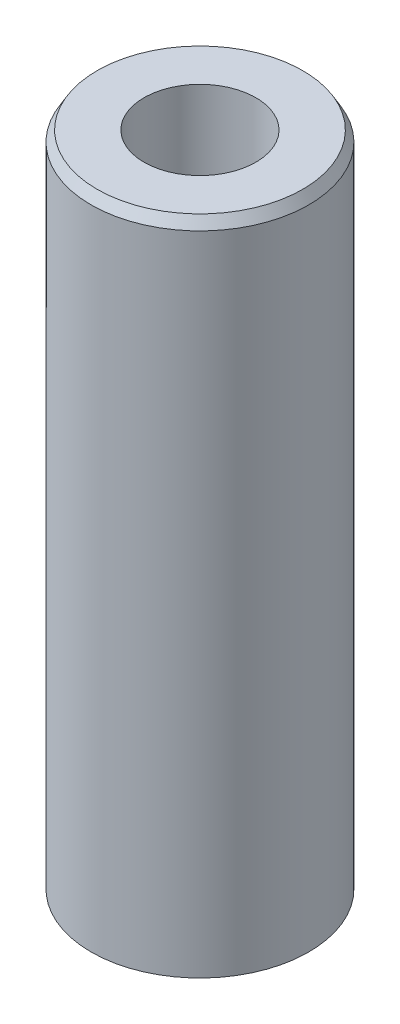
ISO-10303-21;
HEADER;
FILE_DESCRIPTION(('STEP AP214'),'2;1');
FILE_NAME('part.step','',(''),(''),'','','');
FILE_SCHEMA(('AUTOMOTIVE_DESIGN { 1 0 10303 214 1 1 1 1 }'));
ENDSEC;
DATA;
#1=APPLICATION_CONTEXT('core data for automotive mechanical design processes');
#2=APPLICATION_PROTOCOL_DEFINITION('international standard','automotive_design',2000,#1);
#3=PRODUCT_CONTEXT('',#1,'mechanical');
#4=PRODUCT('Part','Part','',(#3));
#5=PRODUCT_RELATED_PRODUCT_CATEGORY('part','',(#4));
#6=PRODUCT_DEFINITION_FORMATION('','',#4);
#7=PRODUCT_DEFINITION_CONTEXT('part definition',#1,'design');
#8=PRODUCT_DEFINITION('design','',#6,#7);
#9=PRODUCT_DEFINITION_SHAPE('','',#8);
#10=(LENGTH_UNIT() NAMED_UNIT(*) SI_UNIT(.MILLI.,.METRE.));
#11=(NAMED_UNIT(*) PLANE_ANGLE_UNIT() SI_UNIT($,.RADIAN.));
#12=(NAMED_UNIT(*) SI_UNIT($,.STERADIAN.) SOLID_ANGLE_UNIT());
#13=UNCERTAINTY_MEASURE_WITH_UNIT(LENGTH_MEASURE(1.E-05),#10,'distance_accuracy_value','');
#14=(GEOMETRIC_REPRESENTATION_CONTEXT(3) GLOBAL_UNCERTAINTY_ASSIGNED_CONTEXT((#13)) GLOBAL_UNIT_ASSIGNED_CONTEXT((#10,
#11,#12)) REPRESENTATION_CONTEXT('',''));
#15=CARTESIAN_POINT('',(0.,0.,0.));
#16=DIRECTION('',(0.,0.,1.));
#17=DIRECTION('',(1.,0.,0.));
#18=AXIS2_PLACEMENT_3D('',#15,#16,#17);
#19=CARTESIAN_POINT('',(0.,289.484519405649,0.));
#20=DIRECTION('',(0.,-1.,0.));
#21=DIRECTION('',(0.,0.,-1.));
#22=AXIS2_PLACEMENT_3D('',#19,#20,#21);
#23=CYLINDRICAL_SURFACE('',#22,47.5);
#24=CARTESIAN_POINT('',(0.,284.92137382186,0.));
#25=DIRECTION('',(0.,1.,0.));
#26=DIRECTION('',(0.,0.,1.));
#27=AXIS2_PLACEMENT_3D('',#24,#25,#26);
#28=CIRCLE('',#27,47.5);
#29=CARTESIAN_POINT('',(0.,284.92137382186,47.5));
#30=VERTEX_POINT('',#29);
#31=EDGE_CURVE('E50',#30,#30,#28,.F.);
#32=ORIENTED_EDGE('',*,*,#31,.T.);
#33=EDGE_LOOP('',(#32));
#34=FACE_BOUND('',#33,.T.);
#35=CARTESIAN_POINT('',(0.,2.6345333311521,0.));
#36=DIRECTION('',(0.,1.,0.));
#37=DIRECTION('',(0.,0.,1.));
#38=AXIS2_PLACEMENT_3D('',#35,#36,#37);
#39=CIRCLE('',#38,47.5);
#40=CARTESIAN_POINT('',(0.,2.6345333311521,47.5));
#41=VERTEX_POINT('',#40);
#42=EDGE_CURVE('E51',#41,#41,#39,.T.);
#43=ORIENTED_EDGE('',*,*,#42,.T.);
#44=EDGE_LOOP('',(#43));
#45=FACE_BOUND('',#44,.T.);
#46=ADVANCED_FACE('F39',(#34,#45),#23,.T.);
#47=CARTESIAN_POINT('',(0.,289.484519405649,0.));
#48=DIRECTION('',(0.,1.,0.));
#49=DIRECTION('',(0.,0.,1.));
#50=AXIS2_PLACEMENT_3D('',#47,#48,#49);
#51=PLANE('',#50);
#52=CARTESIAN_POINT('',(0.,289.484519405649,0.));
#53=DIRECTION('',(0.,1.,0.));
#54=DIRECTION('',(0.,0.,1.));
#55=AXIS2_PLACEMENT_3D('',#52,#53,#54);
#56=CIRCLE('',#55,44.8654666688479);
#57=CARTESIAN_POINT('',(0.,289.484519405649,44.8654666688479));
#58=VERTEX_POINT('',#57);
#59=EDGE_CURVE('E54',#58,#58,#56,.T.);
#60=ORIENTED_EDGE('',*,*,#59,.T.);
#61=EDGE_LOOP('',(#60));
#62=FACE_BOUND('',#61,.T.);
#63=CARTESIAN_POINT('',(0.,289.484519405649,0.));
#64=DIRECTION('',(0.,1.,0.));
#65=DIRECTION('',(0.,0.,1.));
#66=AXIS2_PLACEMENT_3D('',#63,#64,#65);
#67=CIRCLE('',#66,24.3999879885973);
#68=CARTESIAN_POINT('',(0.,289.484519405649,24.3999879885973));
#69=VERTEX_POINT('',#68);
#70=EDGE_CURVE('E58',#69,#69,#67,.T.);
#71=ORIENTED_EDGE('',*,*,#70,.F.);
#72=EDGE_LOOP('',(#71));
#73=FACE_BOUND('',#72,.T.);
#74=ADVANCED_FACE('F69',(#62,#73),#51,.T.);
#75=CARTESIAN_POINT('',(0.,0.,0.));
#76=DIRECTION('',(0.,1.,0.));
#77=DIRECTION('',(0.,0.,1.));
#78=AXIS2_PLACEMENT_3D('',#75,#76,#77);
#79=PLANE('',#78);
#80=CARTESIAN_POINT('',(0.,0.,0.));
#81=DIRECTION('',(0.,1.,0.));
#82=DIRECTION('',(0.,0.,1.));
#83=AXIS2_PLACEMENT_3D('',#80,#81,#82);
#84=CIRCLE('',#83,42.9368544162108);
#85=CARTESIAN_POINT('',(0.,0.,42.9368544162108));
#86=VERTEX_POINT('',#85);
#87=EDGE_CURVE('E10',#86,#86,#84,.F.);
#88=ORIENTED_EDGE('',*,*,#87,.T.);
#89=EDGE_LOOP('',(#88));
#90=FACE_BOUND('',#89,.T.);
#91=CARTESIAN_POINT('',(0.,0.,0.));
#92=DIRECTION('',(0.,1.,0.));
#93=DIRECTION('',(0.,0.,1.));
#94=AXIS2_PLACEMENT_3D('',#91,#92,#93);
#95=CIRCLE('',#94,24.3999879885973);
#96=CARTESIAN_POINT('',(0.,0.,24.3999879885973));
#97=VERTEX_POINT('',#96);
#98=EDGE_CURVE('E63',#97,#97,#95,.T.);
#99=ORIENTED_EDGE('',*,*,#98,.T.);
#100=EDGE_LOOP('',(#99));
#101=FACE_BOUND('',#100,.T.);
#102=ADVANCED_FACE('F75',(#90,#101),#79,.F.);
#103=CARTESIAN_POINT('',(0.,289.484519405649,0.));
#104=DIRECTION('',(0.,-1.,0.));
#105=DIRECTION('',(0.,0.,-1.));
#106=AXIS2_PLACEMENT_3D('',#103,#104,#105);
#107=CYLINDRICAL_SURFACE('',#106,24.3999879885973);
#108=ORIENTED_EDGE('',*,*,#70,.T.);
#109=EDGE_LOOP('',(#108));
#110=FACE_BOUND('',#109,.T.);
#111=ORIENTED_EDGE('',*,*,#98,.F.);
#112=EDGE_LOOP('',(#111));
#113=FACE_BOUND('',#112,.T.);
#114=ADVANCED_FACE('F70',(#110,#113),#107,.F.);
#115=CARTESIAN_POINT('',(0.,289.484519405649,0.));
#116=DIRECTION('',(0.,-1.,0.));
#117=DIRECTION('',(0.,0.,-1.));
#118=AXIS2_PLACEMENT_3D('',#115,#116,#117);
#119=CONICAL_SURFACE('',#118,44.8654666688479,0.523598775598297);
#120=ORIENTED_EDGE('',*,*,#31,.F.);
#121=EDGE_LOOP('',(#120));
#122=FACE_BOUND('',#121,.T.);
#123=ORIENTED_EDGE('',*,*,#59,.F.);
#124=EDGE_LOOP('',(#123));
#125=FACE_BOUND('',#124,.T.);
#126=ADVANCED_FACE('F81',(#122,#125),#119,.T.);
#127=CARTESIAN_POINT('',(0.,2.6345333311521,0.));
#128=DIRECTION('',(0.,1.,0.));
#129=DIRECTION('',(0.,0.,1.));
#130=AXIS2_PLACEMENT_3D('',#127,#128,#129);
#131=CONICAL_SURFACE('',#130,47.5,1.0471975511966);
#132=ORIENTED_EDGE('',*,*,#87,.F.);
#133=EDGE_LOOP('',(#132));
#134=FACE_BOUND('',#133,.T.);
#135=ORIENTED_EDGE('',*,*,#42,.F.);
#136=EDGE_LOOP('',(#135));
#137=FACE_BOUND('',#136,.T.);
#138=ADVANCED_FACE('F45',(#134,#137),#131,.T.);
#139=CLOSED_SHELL('',(#46,#74,#102,#114,#126,#138));
#140=MANIFOLD_SOLID_BREP('B2',#139);
#141=ADVANCED_BREP_SHAPE_REPRESENTATION('',(#18,#140),#14);
#142=SHAPE_DEFINITION_REPRESENTATION(#9,#141);
ENDSEC;
END-ISO-10303-21;
